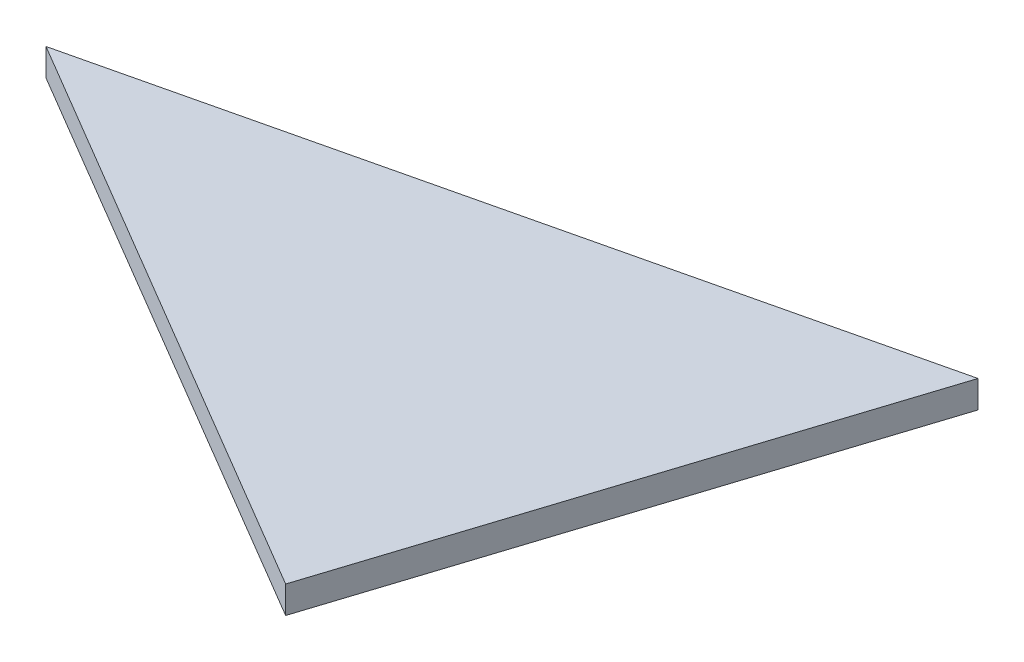
ISO-10303-21;
HEADER;
FILE_DESCRIPTION(('STEP AP214'),'2;1');
FILE_NAME('part.step','',(''),(''),'','','');
FILE_SCHEMA(('AUTOMOTIVE_DESIGN { 1 0 10303 214 1 1 1 1 }'));
ENDSEC;
DATA;
#1=APPLICATION_CONTEXT('core data for automotive mechanical design processes');
#2=APPLICATION_PROTOCOL_DEFINITION('international standard','automotive_design',2000,#1);
#3=PRODUCT_CONTEXT('',#1,'mechanical');
#4=PRODUCT('Part','Part','',(#3));
#5=PRODUCT_RELATED_PRODUCT_CATEGORY('part','',(#4));
#6=PRODUCT_DEFINITION_FORMATION('','',#4);
#7=PRODUCT_DEFINITION_CONTEXT('part definition',#1,'design');
#8=PRODUCT_DEFINITION('design','',#6,#7);
#9=PRODUCT_DEFINITION_SHAPE('','',#8);
#10=(LENGTH_UNIT() NAMED_UNIT(*) SI_UNIT(.MILLI.,.METRE.));
#11=(NAMED_UNIT(*) PLANE_ANGLE_UNIT() SI_UNIT($,.RADIAN.));
#12=(NAMED_UNIT(*) SI_UNIT($,.STERADIAN.) SOLID_ANGLE_UNIT());
#13=UNCERTAINTY_MEASURE_WITH_UNIT(LENGTH_MEASURE(1.E-05),#10,'distance_accuracy_value','');
#14=(GEOMETRIC_REPRESENTATION_CONTEXT(3) GLOBAL_UNCERTAINTY_ASSIGNED_CONTEXT((#13)) GLOBAL_UNIT_ASSIGNED_CONTEXT((#10,
#11,#12)) REPRESENTATION_CONTEXT('',''));
#15=CARTESIAN_POINT('',(0.,0.,0.));
#16=DIRECTION('',(0.,0.,1.));
#17=DIRECTION('',(1.,0.,0.));
#18=AXIS2_PLACEMENT_3D('',#15,#16,#17);
#19=CARTESIAN_POINT('',(42.9150811116249,2.,25.3443447968703));
#20=DIRECTION('',(-0.952200624232351,0.,-0.30547335597646));
#21=DIRECTION('',(-0.30547335597646,0.,0.952200624232351));
#22=AXIS2_PLACEMENT_3D('',#19,#20,#21);
#23=PLANE('',#22);
#24=DIRECTION('',(0.30547335597646,0.,-0.952200624232351));
#25=VECTOR('',#24,1.);
#26=CARTESIAN_POINT('',(42.9150811116249,0.,25.3443447968703));
#27=LINE('',#26,#25);
#28=CARTESIAN_POINT('',(42.9150811116249,0.,25.3443447968703));
#29=VERTEX_POINT('',#28);
#30=CARTESIAN_POINT('',(55.2442521747405,0.,-13.0873028505625));
#31=VERTEX_POINT('',#30);
#32=EDGE_CURVE('E89',#29,#31,#27,.T.);
#33=ORIENTED_EDGE('',*,*,#32,.T.);
#34=DIRECTION('',(0.,-1.,0.));
#35=VECTOR('',#34,1.);
#36=CARTESIAN_POINT('',(55.2442521747405,2.,-13.0873028505625));
#37=LINE('',#36,#35);
#38=CARTESIAN_POINT('',(55.2442521747405,2.,-13.0873028505625));
#39=VERTEX_POINT('',#38);
#40=EDGE_CURVE('E11',#39,#31,#37,.T.);
#41=ORIENTED_EDGE('',*,*,#40,.F.);
#42=DIRECTION('',(0.30547335597646,0.,-0.952200624232351));
#43=VECTOR('',#42,1.);
#44=CARTESIAN_POINT('',(42.9150811116249,2.,25.3443447968703));
#45=LINE('',#44,#43);
#46=CARTESIAN_POINT('',(42.9150811116249,2.,25.3443447968703));
#47=VERTEX_POINT('',#46);
#48=EDGE_CURVE('E81',#47,#39,#45,.T.);
#49=ORIENTED_EDGE('',*,*,#48,.F.);
#50=DIRECTION('',(0.,-1.,0.));
#51=VECTOR('',#50,1.);
#52=CARTESIAN_POINT('',(42.9150811116249,2.,25.3443447968703));
#53=LINE('',#52,#51);
#54=EDGE_CURVE('E90',#47,#29,#53,.T.);
#55=ORIENTED_EDGE('',*,*,#54,.T.);
#56=EDGE_LOOP('',(#33,#41,#49,#55));
#57=FACE_BOUND('',#56,.T.);
#58=ADVANCED_FACE('F39',(#57),#23,.F.);
#59=CARTESIAN_POINT('',(55.2442521747405,2.,-13.0873028505625));
#60=DIRECTION('',(0.230518717940651,0.,0.973067891094449));
#61=DIRECTION('',(0.973067891094449,0.,-0.230518717940651));
#62=AXIS2_PLACEMENT_3D('',#59,#60,#61);
#63=PLANE('',#62);
#64=DIRECTION('',(-0.973067891094449,0.,0.230518717940651));
#65=VECTOR('',#64,1.);
#66=CARTESIAN_POINT('',(55.2442521747405,0.,-13.0873028505625));
#67=LINE('',#66,#65);
#68=CARTESIAN_POINT('',(0.,0.,0.));
#69=VERTEX_POINT('',#68);
#70=EDGE_CURVE('E68',#31,#69,#67,.T.);
#71=ORIENTED_EDGE('',*,*,#70,.T.);
#72=DIRECTION('',(0.,-1.,0.));
#73=VECTOR('',#72,1.);
#74=CARTESIAN_POINT('',(0.,2.,0.));
#75=LINE('',#74,#73);
#76=CARTESIAN_POINT('',(0.,2.,0.));
#77=VERTEX_POINT('',#76);
#78=EDGE_CURVE('E48',#77,#69,#75,.T.);
#79=ORIENTED_EDGE('',*,*,#78,.F.);
#80=DIRECTION('',(-0.973067891094449,0.,0.230518717940651));
#81=VECTOR('',#80,1.);
#82=CARTESIAN_POINT('',(55.2442521747405,2.,-13.0873028505625));
#83=LINE('',#82,#81);
#84=EDGE_CURVE('E76',#39,#77,#83,.T.);
#85=ORIENTED_EDGE('',*,*,#84,.F.);
#86=ORIENTED_EDGE('',*,*,#40,.T.);
#87=EDGE_LOOP('',(#71,#79,#85,#86));
#88=FACE_BOUND('',#87,.T.);
#89=ADVANCED_FACE('F77',(#88),#63,.F.);
#90=CARTESIAN_POINT('',(0.,2.,0.));
#91=DIRECTION('',(0.508512667256779,0.,-0.861054508866539));
#92=DIRECTION('',(-0.861054508866539,0.,-0.508512667256779));
#93=AXIS2_PLACEMENT_3D('',#90,#91,#92);
#94=PLANE('',#93);
#95=DIRECTION('',(0.861054508866539,0.,0.508512667256779));
#96=VECTOR('',#95,1.);
#97=CARTESIAN_POINT('',(0.,0.,0.));
#98=LINE('',#97,#96);
#99=EDGE_CURVE('E73',#69,#29,#98,.T.);
#100=ORIENTED_EDGE('',*,*,#99,.T.);
#101=ORIENTED_EDGE('',*,*,#54,.F.);
#102=DIRECTION('',(0.861054508866539,0.,0.508512667256779));
#103=VECTOR('',#102,1.);
#104=CARTESIAN_POINT('',(0.,2.,0.));
#105=LINE('',#104,#103);
#106=EDGE_CURVE('E56',#77,#47,#105,.T.);
#107=ORIENTED_EDGE('',*,*,#106,.F.);
#108=ORIENTED_EDGE('',*,*,#78,.T.);
#109=EDGE_LOOP('',(#100,#101,#107,#108));
#110=FACE_BOUND('',#109,.T.);
#111=ADVANCED_FACE('F102',(#110),#94,.F.);
#112=CARTESIAN_POINT('',(0.,2.,0.));
#113=DIRECTION('',(0.,-1.,0.));
#114=DIRECTION('',(0.,0.,-1.));
#115=AXIS2_PLACEMENT_3D('',#112,#113,#114);
#116=PLANE('',#115);
#117=ORIENTED_EDGE('',*,*,#48,.T.);
#118=ORIENTED_EDGE('',*,*,#84,.T.);
#119=ORIENTED_EDGE('',*,*,#106,.T.);
#120=EDGE_LOOP('',(#117,#118,#119));
#121=FACE_BOUND('',#120,.T.);
#122=ADVANCED_FACE('F84',(#121),#116,.F.);
#123=CARTESIAN_POINT('',(0.,0.,0.));
#124=DIRECTION('',(0.,-1.,0.));
#125=DIRECTION('',(0.,0.,-1.));
#126=AXIS2_PLACEMENT_3D('',#123,#124,#125);
#127=PLANE('',#126);
#128=ORIENTED_EDGE('',*,*,#32,.F.);
#129=ORIENTED_EDGE('',*,*,#99,.F.);
#130=ORIENTED_EDGE('',*,*,#70,.F.);
#131=EDGE_LOOP('',(#128,#129,#130));
#132=FACE_BOUND('',#131,.T.);
#133=ADVANCED_FACE('F103',(#132),#127,.T.);
#134=CLOSED_SHELL('',(#58,#89,#111,#122,#133));
#135=MANIFOLD_SOLID_BREP('B2',#134);
#136=ADVANCED_BREP_SHAPE_REPRESENTATION('',(#18,#135),#14);
#137=SHAPE_DEFINITION_REPRESENTATION(#9,#136);
ENDSEC;
END-ISO-10303-21;
